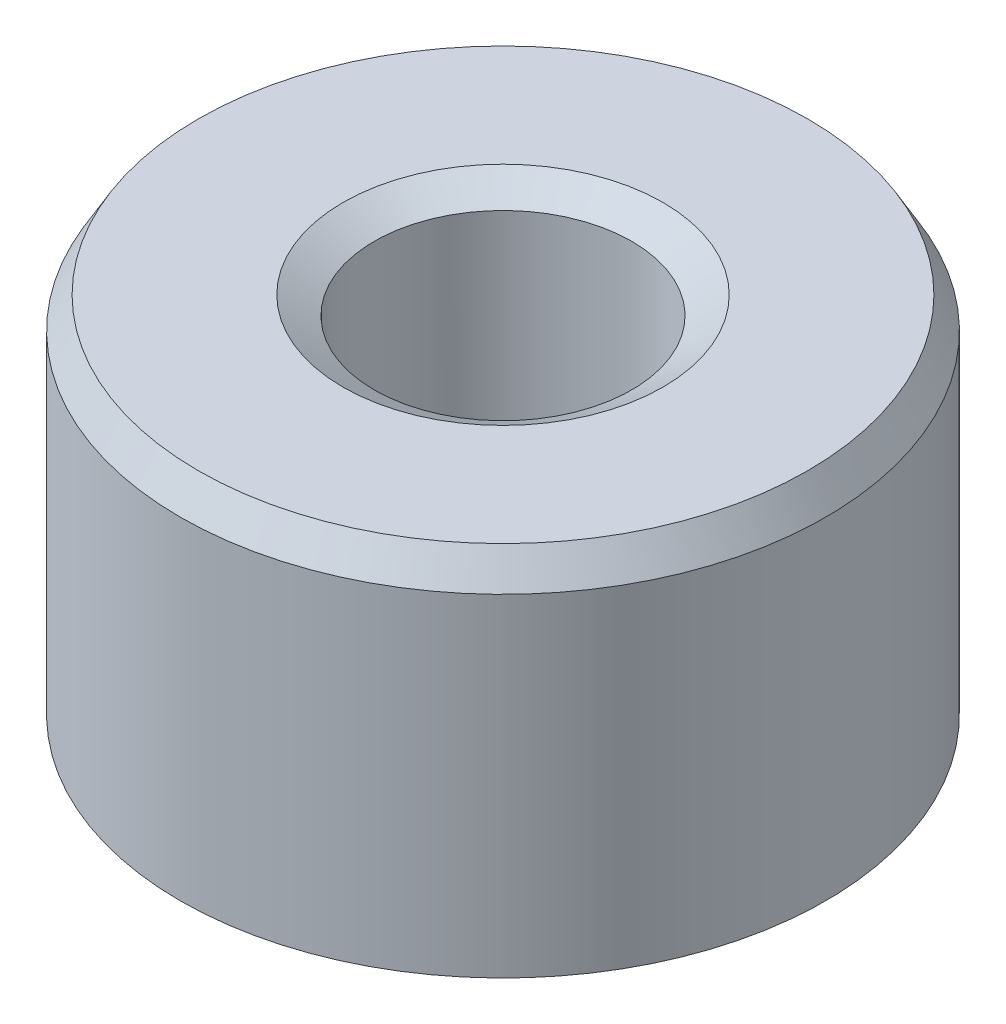
ISO-10303-21;
HEADER;
FILE_DESCRIPTION(('STEP AP214'),'2;1');
FILE_NAME('part.step','',(''),(''),'','','');
FILE_SCHEMA(('AUTOMOTIVE_DESIGN { 1 0 10303 214 1 1 1 1 }'));
ENDSEC;
DATA;
#1=APPLICATION_CONTEXT('core data for automotive mechanical design processes');
#2=APPLICATION_PROTOCOL_DEFINITION('international standard','automotive_design',2000,#1);
#3=PRODUCT_CONTEXT('',#1,'mechanical');
#4=PRODUCT('Part','Part','',(#3));
#5=PRODUCT_RELATED_PRODUCT_CATEGORY('part','',(#4));
#6=PRODUCT_DEFINITION_FORMATION('','',#4);
#7=PRODUCT_DEFINITION_CONTEXT('part definition',#1,'design');
#8=PRODUCT_DEFINITION('design','',#6,#7);
#9=PRODUCT_DEFINITION_SHAPE('','',#8);
#10=(LENGTH_UNIT() NAMED_UNIT(*) SI_UNIT(.MILLI.,.METRE.));
#11=(NAMED_UNIT(*) PLANE_ANGLE_UNIT() SI_UNIT($,.RADIAN.));
#12=(NAMED_UNIT(*) SI_UNIT($,.STERADIAN.) SOLID_ANGLE_UNIT());
#13=UNCERTAINTY_MEASURE_WITH_UNIT(LENGTH_MEASURE(1.E-05),#10,'distance_accuracy_value','');
#14=(GEOMETRIC_REPRESENTATION_CONTEXT(3) GLOBAL_UNCERTAINTY_ASSIGNED_CONTEXT((#13)) GLOBAL_UNIT_ASSIGNED_CONTEXT((#10,
#11,#12)) REPRESENTATION_CONTEXT('',''));
#15=CARTESIAN_POINT('',(0.,0.,0.));
#16=DIRECTION('',(0.,0.,1.));
#17=DIRECTION('',(1.,0.,0.));
#18=AXIS2_PLACEMENT_3D('',#15,#16,#17);
#19=CARTESIAN_POINT('',(0.,41.3737613750609,0.));
#20=DIRECTION('',(0.,-1.,0.));
#21=DIRECTION('',(0.,0.,-1.));
#22=AXIS2_PLACEMENT_3D('',#19,#20,#21);
#23=CYLINDRICAL_SURFACE('',#22,35.);
#24=CARTESIAN_POINT('',(0.,1.95443543057106,0.));
#25=DIRECTION('',(0.,1.,0.));
#26=DIRECTION('',(0.,0.,1.));
#27=AXIS2_PLACEMENT_3D('',#24,#25,#26);
#28=CIRCLE('',#27,35.);
#29=CARTESIAN_POINT('',(0.,1.95443543057105,-35.));
#30=VERTEX_POINT('',#29);
#31=EDGE_CURVE('E10',#30,#30,#28,.T.);
#32=CARTESIAN_POINT('',(0.,37.9885799091992,0.));
#33=DIRECTION('',(0.,1.,0.));
#34=DIRECTION('',(0.,0.,1.));
#35=AXIS2_PLACEMENT_3D('',#32,#33,#34);
#36=CIRCLE('',#35,35.);
#37=CARTESIAN_POINT('',(0.,37.9885799091992,-35.));
#38=VERTEX_POINT('',#37);
#39=EDGE_CURVE('E50',#38,#38,#36,.F.);
#40=CARTESIAN_POINT('',(0.,1.95443543057105,-35.));
#41=CARTESIAN_POINT('',(0.,2.32979110222342,-35.));
#42=CARTESIAN_POINT('',(0.,2.7051467738758,-35.));
#43=CARTESIAN_POINT('',(0.,3.45585811718055,-35.));
#44=CARTESIAN_POINT('',(0.,3.83121378883293,-35.));
#45=CARTESIAN_POINT('',(0.,4.58192513213769,-35.));
#46=CARTESIAN_POINT('',(0.,4.95728080379006,-35.));
#47=CARTESIAN_POINT('',(0.,5.70799214709481,-35.));
#48=CARTESIAN_POINT('',(0.,6.08334781874719,-35.));
#49=CARTESIAN_POINT('',(0.,6.83405916205195,-35.));
#50=CARTESIAN_POINT('',(0.,7.20941483370432,-35.));
#51=CARTESIAN_POINT('',(0.,7.96012617700907,-35.));
#52=CARTESIAN_POINT('',(0.,8.33548184866145,-35.));
#53=CARTESIAN_POINT('',(0.,9.0861931919662,-35.));
#54=CARTESIAN_POINT('',(0.,9.46154886361858,-35.));
#55=CARTESIAN_POINT('',(0.,10.2122602069233,-35.));
#56=CARTESIAN_POINT('',(0.,10.5876158785757,-35.));
#57=CARTESIAN_POINT('',(0.,11.3383272218805,-35.));
#58=CARTESIAN_POINT('',(0.,11.7136828935328,-35.));
#59=CARTESIAN_POINT('',(0.,12.4643942368376,-35.));
#60=CARTESIAN_POINT('',(0.,12.83974990849,-35.));
#61=CARTESIAN_POINT('',(0.,13.5904612517947,-35.));
#62=CARTESIAN_POINT('',(0.,13.9658169234471,-35.));
#63=CARTESIAN_POINT('',(0.,14.7165282667518,-35.));
#64=CARTESIAN_POINT('',(0.,15.0918839384042,-35.));
#65=CARTESIAN_POINT('',(0.,15.842595281709,-35.));
#66=CARTESIAN_POINT('',(0.,16.2179509533614,-35.));
#67=CARTESIAN_POINT('',(0.,16.9686622966661,-35.));
#68=CARTESIAN_POINT('',(0.,17.3440179683185,-35.));
#69=CARTESIAN_POINT('',(0.,18.0947293116232,-35.));
#70=CARTESIAN_POINT('',(0.,18.4700849832756,-35.));
#71=CARTESIAN_POINT('',(0.,19.2207963265804,-35.));
#72=CARTESIAN_POINT('',(0.,19.5961519982327,-35.));
#73=CARTESIAN_POINT('',(0.,20.3468633415375,-35.));
#74=CARTESIAN_POINT('',(0.,20.7222190131899,-35.));
#75=CARTESIAN_POINT('',(0.,21.4729303564946,-35.));
#76=CARTESIAN_POINT('',(0.,21.848286028147,-35.));
#77=CARTESIAN_POINT('',(0.,22.5989973714518,-35.));
#78=CARTESIAN_POINT('',(0.,22.9743530431041,-35.));
#79=CARTESIAN_POINT('',(0.,23.7250643864089,-35.));
#80=CARTESIAN_POINT('',(0.,24.1004200580613,-35.));
#81=CARTESIAN_POINT('',(0.,24.851131401366,-35.));
#82=CARTESIAN_POINT('',(0.,25.2264870730184,-35.));
#83=CARTESIAN_POINT('',(0.,25.9771984163231,-35.));
#84=CARTESIAN_POINT('',(0.,26.3525540879755,-35.));
#85=CARTESIAN_POINT('',(0.,27.1032654312803,-35.));
#86=CARTESIAN_POINT('',(0.,27.4786211029327,-35.));
#87=CARTESIAN_POINT('',(0.,28.2293324462374,-35.));
#88=CARTESIAN_POINT('',(0.,28.6046881178898,-35.));
#89=CARTESIAN_POINT('',(0.,29.3553994611945,-35.));
#90=CARTESIAN_POINT('',(0.,29.7307551328469,-35.));
#91=CARTESIAN_POINT('',(0.,30.4814664761517,-35.));
#92=CARTESIAN_POINT('',(0.,30.856822147804,-35.));
#93=CARTESIAN_POINT('',(0.,31.6075334911088,-35.));
#94=CARTESIAN_POINT('',(0.,31.9828891627612,-35.));
#95=CARTESIAN_POINT('',(0.,32.7336005060659,-35.));
#96=CARTESIAN_POINT('',(0.,33.1089561777183,-35.));
#97=CARTESIAN_POINT('',(0.,33.8596675210231,-35.));
#98=CARTESIAN_POINT('',(0.,34.2350231926754,-35.));
#99=CARTESIAN_POINT('',(0.,34.9857345359802,-35.));
#100=CARTESIAN_POINT('',(0.,35.3610902076326,-35.));
#101=CARTESIAN_POINT('',(0.,36.1118015509373,-35.));
#102=CARTESIAN_POINT('',(0.,36.4871572225897,-35.));
#103=CARTESIAN_POINT('',(0.,37.2378685658944,-35.));
#104=CARTESIAN_POINT('',(0.,37.6132242375468,-35.));
#105=CARTESIAN_POINT('',(0.,37.9885799091992,-35.));
#106=B_SPLINE_CURVE_WITH_KNOTS('',3,(#40,#41,#42,#43,#44,#45,#46,#47,#48,#49,#50,#51,#52,#53,
#54,#55,#56,#57,#58,#59,#60,#61,#62,#63,#64,#65,#66,#67,#68,#69,#70,#71,#72,#73,#74,#75,#76,#77,
#78,#79,#80,#81,#82,#83,#84,#85,#86,#87,#88,#89,#90,#91,#92,#93,#94,#95,#96,#97,#98,#99,#100,
#101,#102,#103,#104,#105),.UNSPECIFIED.,.F.,.F.,(4,2,2,2,2,2,2,2,2,2,2,2,2,2,2,2,2,2,2,2,2,2,2,
2,2,2,2,2,2,2,2,2,4),(0.,1.12606701495713,2.25213402991426,3.37820104487139,4.50426805982852,
5.63033507478565,6.75640208974278,7.8824691046999,9.00853611965704,10.1346031346142,
11.2606701495713,12.3867371645284,13.5128041794856,14.6388711944427,15.7649382093998,
16.8910052243569,18.0170722393141,19.1431392542712,20.2692062692283,21.3952732841855,
22.5213402991426,23.6474073140997,24.7734743290568,25.899541344014,27.0256083589711,
28.1516753739282,29.2777423888854,30.4038094038425,31.5298764187996,32.6559434337568,
33.7820104487139,34.908077463671,36.0341444786281),.UNSPECIFIED.);
#107=EDGE_CURVE('BSEAM39',#30,#38,#106,.T.);
#108=ORIENTED_EDGE('',*,*,#31,.T.);
#109=ORIENTED_EDGE('',*,*,#39,.T.);
#110=ORIENTED_EDGE('',*,*,#107,.T.);
#111=ORIENTED_EDGE('',*,*,#107,.F.);
#112=EDGE_LOOP('',(#108,#110,#109,#111));
#113=FACE_BOUND('',#112,.T.);
#114=ADVANCED_FACE('F39',(#113),#23,.T.);
#115=CARTESIAN_POINT('',(0.,41.3737613750609,0.));
#116=DIRECTION('',(0.,1.,0.));
#117=DIRECTION('',(0.,0.,1.));
#118=AXIS2_PLACEMENT_3D('',#115,#116,#117);
#119=PLANE('',#118);
#120=CARTESIAN_POINT('',(0.,41.3737613750609,0.));
#121=DIRECTION('',(0.,1.,0.));
#122=DIRECTION('',(0.,0.,1.));
#123=AXIS2_PLACEMENT_3D('',#120,#121,#122);
#124=CIRCLE('',#123,17.3493188126822);
#125=CARTESIAN_POINT('',(0.,41.3737613750609,17.3493188126822));
#126=VERTEX_POINT('',#125);
#127=EDGE_CURVE('E58',#126,#126,#124,.F.);
#128=ORIENTED_EDGE('',*,*,#127,.T.);
#129=EDGE_LOOP('',(#128));
#130=FACE_BOUND('',#129,.T.);
#131=CARTESIAN_POINT('',(0.,41.3737613750609,0.));
#132=DIRECTION('',(0.,1.,0.));
#133=DIRECTION('',(0.,0.,1.));
#134=AXIS2_PLACEMENT_3D('',#131,#132,#133);
#135=CIRCLE('',#134,33.045564569429);
#136=CARTESIAN_POINT('',(0.,41.3737613750609,33.045564569429));
#137=VERTEX_POINT('',#136);
#138=EDGE_CURVE('E61',#137,#137,#135,.T.);
#139=ORIENTED_EDGE('',*,*,#138,.T.);
#140=EDGE_LOOP('',(#139));
#141=FACE_BOUND('',#140,.T.);
#142=ADVANCED_FACE('F88',(#130,#141),#119,.T.);
#143=CARTESIAN_POINT('',(0.,0.,0.));
#144=DIRECTION('',(0.,1.,0.));
#145=DIRECTION('',(0.,0.,1.));
#146=AXIS2_PLACEMENT_3D('',#143,#144,#145);
#147=PLANE('',#146);
#148=CARTESIAN_POINT('',(0.,0.,0.));
#149=DIRECTION('',(0.,1.,0.));
#150=DIRECTION('',(0.,0.,1.));
#151=AXIS2_PLACEMENT_3D('',#148,#149,#150);
#152=CIRCLE('',#151,15.9185727773913);
#153=CARTESIAN_POINT('',(0.,0.,15.9185727773913));
#154=VERTEX_POINT('',#153);
#155=EDGE_CURVE('E51',#154,#154,#152,.T.);
#156=ORIENTED_EDGE('',*,*,#155,.T.);
#157=EDGE_LOOP('',(#156));
#158=FACE_BOUND('',#157,.T.);
#159=CARTESIAN_POINT('',(0.,0.,0.));
#160=DIRECTION('',(0.,1.,0.));
#161=DIRECTION('',(0.,0.,1.));
#162=AXIS2_PLACEMENT_3D('',#159,#160,#161);
#163=CIRCLE('',#162,31.6148185341382);
#164=CARTESIAN_POINT('',(0.,0.,31.6148185341382));
#165=VERTEX_POINT('',#164);
#166=EDGE_CURVE('E54',#165,#165,#163,.F.);
#167=ORIENTED_EDGE('',*,*,#166,.T.);
#168=EDGE_LOOP('',(#167));
#169=FACE_BOUND('',#168,.T.);
#170=ADVANCED_FACE('F83',(#158,#169),#147,.F.);
#171=CARTESIAN_POINT('',(0.,41.3737613750609,0.));
#172=DIRECTION('',(0.,-1.,0.));
#173=DIRECTION('',(0.,0.,-1.));
#174=AXIS2_PLACEMENT_3D('',#171,#172,#173);
#175=CYLINDRICAL_SURFACE('',#174,13.9641373468203);
#176=CARTESIAN_POINT('',(0.,39.4193259444899,0.));
#177=DIRECTION('',(0.,1.,0.));
#178=DIRECTION('',(0.,0.,1.));
#179=AXIS2_PLACEMENT_3D('',#176,#177,#178);
#180=CIRCLE('',#179,13.9641373468203);
#181=CARTESIAN_POINT('',(0.,39.4193259444898,-13.9641373468203));
#182=VERTEX_POINT('',#181);
#183=EDGE_CURVE('E67',#182,#182,#180,.T.);
#184=CARTESIAN_POINT('',(0.,3.38518146586177,0.));
#185=DIRECTION('',(0.,1.,0.));
#186=DIRECTION('',(0.,0.,1.));
#187=AXIS2_PLACEMENT_3D('',#184,#185,#186);
#188=CIRCLE('',#187,13.9641373468203);
#189=CARTESIAN_POINT('',(0.,3.38518146586176,-13.9641373468203));
#190=VERTEX_POINT('',#189);
#191=EDGE_CURVE('E69',#190,#190,#188,.F.);
#192=CARTESIAN_POINT('',(0.,39.4193259444898,-13.9641373468203));
#193=CARTESIAN_POINT('',(0.,39.0439702728375,-13.9641373468203));
#194=CARTESIAN_POINT('',(0.,38.6686146011851,-13.9641373468203));
#195=CARTESIAN_POINT('',(0.,37.9179032578803,-13.9641373468203));
#196=CARTESIAN_POINT('',(0.,37.542547586228,-13.9641373468203));
#197=CARTESIAN_POINT('',(0.,36.7918362429232,-13.9641373468203));
#198=CARTESIAN_POINT('',(0.,36.4164805712708,-13.9641373468203));
#199=CARTESIAN_POINT('',(0.,35.6657692279661,-13.9641373468203));
#200=CARTESIAN_POINT('',(0.,35.2904135563137,-13.9641373468203));
#201=CARTESIAN_POINT('',(0.,34.539702213009,-13.9641373468203));
#202=CARTESIAN_POINT('',(0.,34.1643465413566,-13.9641373468203));
#203=CARTESIAN_POINT('',(0.,33.4136351980518,-13.9641373468203));
#204=CARTESIAN_POINT('',(0.,33.0382795263995,-13.9641373468203));
#205=CARTESIAN_POINT('',(0.,32.2875681830947,-13.9641373468203));
#206=CARTESIAN_POINT('',(0.,31.9122125114423,-13.9641373468203));
#207=CARTESIAN_POINT('',(0.,31.1615011681376,-13.9641373468203));
#208=CARTESIAN_POINT('',(0.,30.7861454964852,-13.9641373468203));
#209=CARTESIAN_POINT('',(0.,30.0354341531805,-13.9641373468203));
#210=CARTESIAN_POINT('',(0.,29.6600784815281,-13.9641373468203));
#211=CARTESIAN_POINT('',(0.,28.9093671382233,-13.9641373468203));
#212=CARTESIAN_POINT('',(0.,28.5340114665709,-13.9641373468203));
#213=CARTESIAN_POINT('',(0.,27.7833001232662,-13.9641373468203));
#214=CARTESIAN_POINT('',(0.,27.4079444516138,-13.9641373468203));
#215=CARTESIAN_POINT('',(0.,26.6572331083091,-13.9641373468203));
#216=CARTESIAN_POINT('',(0.,26.2818774366567,-13.9641373468203));
#217=CARTESIAN_POINT('',(0.,25.5311660933519,-13.9641373468203));
#218=CARTESIAN_POINT('',(0.,25.1558104216996,-13.9641373468203));
#219=CARTESIAN_POINT('',(0.,24.4050990783948,-13.9641373468203));
#220=CARTESIAN_POINT('',(0.,24.0297434067424,-13.9641373468203));
#221=CARTESIAN_POINT('',(0.,23.2790320634377,-13.9641373468203));
#222=CARTESIAN_POINT('',(0.,22.9036763917853,-13.9641373468203));
#223=CARTESIAN_POINT('',(0.,22.1529650484806,-13.9641373468203));
#224=CARTESIAN_POINT('',(0.,21.7776093768282,-13.9641373468203));
#225=CARTESIAN_POINT('',(0.,21.0268980335234,-13.9641373468203));
#226=CARTESIAN_POINT('',(0.,20.6515423618711,-13.9641373468203));
#227=CARTESIAN_POINT('',(0.,19.9008310185663,-13.9641373468203));
#228=CARTESIAN_POINT('',(0.,19.5254753469139,-13.9641373468203));
#229=CARTESIAN_POINT('',(0.,18.7747640036092,-13.9641373468203));
#230=CARTESIAN_POINT('',(0.,18.3994083319568,-13.9641373468203));
#231=CARTESIAN_POINT('',(0.,17.648696988652,-13.9641373468203));
#232=CARTESIAN_POINT('',(0.,17.2733413169997,-13.9641373468203));
#233=CARTESIAN_POINT('',(0.,16.5226299736949,-13.9641373468203));
#234=CARTESIAN_POINT('',(0.,16.1472743020425,-13.9641373468203));
#235=CARTESIAN_POINT('',(0.,15.3965629587378,-13.9641373468203));
#236=CARTESIAN_POINT('',(0.,15.0212072870854,-13.9641373468203));
#237=CARTESIAN_POINT('',(0.,14.2704959437807,-13.9641373468203));
#238=CARTESIAN_POINT('',(0.,13.8951402721283,-13.9641373468203));
#239=CARTESIAN_POINT('',(0.,13.1444289288235,-13.9641373468203));
#240=CARTESIAN_POINT('',(0.,12.7690732571712,-13.9641373468203));
#241=CARTESIAN_POINT('',(0.,12.0183619138664,-13.9641373468203));
#242=CARTESIAN_POINT('',(0.,11.643006242214,-13.9641373468203));
#243=CARTESIAN_POINT('',(0.,10.8922948989093,-13.9641373468203));
#244=CARTESIAN_POINT('',(0.,10.5169392272569,-13.9641373468203));
#245=CARTESIAN_POINT('',(0.,9.76622788395215,-13.9641373468203));
#246=CARTESIAN_POINT('',(0.,9.39087221229978,-13.9641373468203));
#247=CARTESIAN_POINT('',(0.,8.64016086899503,-13.9641373468203));
#248=CARTESIAN_POINT('',(0.,8.26480519734265,-13.9641373468203));
#249=CARTESIAN_POINT('',(0.,7.51409385403789,-13.9641373468203));
#250=CARTESIAN_POINT('',(0.,7.13873818238552,-13.9641373468203));
#251=CARTESIAN_POINT('',(0.,6.38802683908077,-13.9641373468203));
#252=CARTESIAN_POINT('',(0.,6.01267116742839,-13.9641373468203));
#253=CARTESIAN_POINT('',(0.,5.26195982412364,-13.9641373468203));
#254=CARTESIAN_POINT('',(0.,4.88660415247126,-13.9641373468203));
#255=CARTESIAN_POINT('',(0.,4.13589280916651,-13.9641373468203));
#256=CARTESIAN_POINT('',(0.,3.76053713751414,-13.9641373468203));
#257=CARTESIAN_POINT('',(0.,3.38518146586176,-13.9641373468203));
#258=B_SPLINE_CURVE_WITH_KNOTS('',3,(#192,#193,#194,#195,#196,#197,#198,#199,#200,#201,#202,
#203,#204,#205,#206,#207,#208,#209,#210,#211,#212,#213,#214,#215,#216,#217,#218,#219,#220,#221,
#222,#223,#224,#225,#226,#227,#228,#229,#230,#231,#232,#233,#234,#235,#236,#237,#238,#239,#240,
#241,#242,#243,#244,#245,#246,#247,#248,#249,#250,#251,#252,#253,#254,#255,#256,#257),
.UNSPECIFIED.,.F.,.F.,(4,2,2,2,2,2,2,2,2,2,2,2,2,2,2,2,2,2,2,2,2,2,2,2,2,2,2,2,2,2,2,2,4),(0.,
1.12606701495713,2.25213402991425,3.37820104487138,4.50426805982851,5.63033507478564,
6.75640208974276,7.88246910469989,9.00853611965702,10.1346031346141,11.2606701495713,
12.3867371645284,13.5128041794855,14.6388711944427,15.7649382093998,16.8910052243569,
18.017072239314,19.1431392542712,20.2692062692283,21.3952732841854,22.5213402991426,
23.6474073140997,24.7734743290568,25.8995413440139,27.0256083589711,28.1516753739282,
29.2777423888853,30.4038094038424,31.5298764187996,32.6559434337567,33.7820104487138,
34.908077463671,36.0341444786281),.UNSPECIFIED.);
#259=EDGE_CURVE('BSEAM71',#182,#190,#258,.T.);
#260=ORIENTED_EDGE('',*,*,#183,.T.);
#261=ORIENTED_EDGE('',*,*,#191,.T.);
#262=ORIENTED_EDGE('',*,*,#259,.T.);
#263=ORIENTED_EDGE('',*,*,#259,.F.);
#264=EDGE_LOOP('',(#260,#262,#261,#263));
#265=FACE_BOUND('',#264,.T.);
#266=ADVANCED_FACE('F71',(#265),#175,.F.);
#267=CARTESIAN_POINT('',(0.,39.4193259444899,0.));
#268=DIRECTION('',(0.,1.,0.));
#269=DIRECTION('',(0.,0.,1.));
#270=AXIS2_PLACEMENT_3D('',#267,#268,#269);
#271=CONICAL_SURFACE('',#270,13.9641373468203,1.0471975511966);
#272=ORIENTED_EDGE('',*,*,#127,.F.);
#273=EDGE_LOOP('',(#272));
#274=FACE_BOUND('',#273,.T.);
#275=ORIENTED_EDGE('',*,*,#183,.F.);
#276=EDGE_LOOP('',(#275));
#277=FACE_BOUND('',#276,.T.);
#278=ADVANCED_FACE('F77',(#274,#277),#271,.F.);
#279=CARTESIAN_POINT('',(0.,0.,0.));
#280=DIRECTION('',(0.,-1.,0.));
#281=DIRECTION('',(0.,0.,-1.));
#282=AXIS2_PLACEMENT_3D('',#279,#280,#281);
#283=CONICAL_SURFACE('',#282,15.9185727773913,0.523598775598293);
#284=ORIENTED_EDGE('',*,*,#191,.F.);
#285=EDGE_LOOP('',(#284));
#286=FACE_BOUND('',#285,.T.);
#287=ORIENTED_EDGE('',*,*,#155,.F.);
#288=EDGE_LOOP('',(#287));
#289=FACE_BOUND('',#288,.T.);
#290=ADVANCED_FACE('F73',(#286,#289),#283,.F.);
#291=CARTESIAN_POINT('',(0.,1.95443543057106,0.));
#292=DIRECTION('',(0.,1.,0.));
#293=DIRECTION('',(0.,0.,1.));
#294=AXIS2_PLACEMENT_3D('',#291,#292,#293);
#295=CONICAL_SURFACE('',#294,35.,1.0471975511966);
#296=ORIENTED_EDGE('',*,*,#166,.F.);
#297=EDGE_LOOP('',(#296));
#298=FACE_BOUND('',#297,.T.);
#299=ORIENTED_EDGE('',*,*,#31,.F.);
#300=EDGE_LOOP('',(#299));
#301=FACE_BOUND('',#300,.T.);
#302=ADVANCED_FACE('F76',(#298,#301),#295,.T.);
#303=CARTESIAN_POINT('',(0.,41.3737613750609,0.));
#304=DIRECTION('',(0.,-1.,0.));
#305=DIRECTION('',(0.,0.,-1.));
#306=AXIS2_PLACEMENT_3D('',#303,#304,#305);
#307=CONICAL_SURFACE('',#306,33.045564569429,0.523598775598295);
#308=ORIENTED_EDGE('',*,*,#39,.F.);
#309=EDGE_LOOP('',(#308));
#310=FACE_BOUND('',#309,.T.);
#311=ORIENTED_EDGE('',*,*,#138,.F.);
#312=EDGE_LOOP('',(#311));
#313=FACE_BOUND('',#312,.T.);
#314=ADVANCED_FACE('F45',(#310,#313),#307,.T.);
#315=CLOSED_SHELL('',(#114,#142,#170,#266,#278,#290,#302,#314));
#316=MANIFOLD_SOLID_BREP('B2',#315);
#317=ADVANCED_BREP_SHAPE_REPRESENTATION('',(#18,#316),#14);
#318=SHAPE_DEFINITION_REPRESENTATION(#9,#317);
ENDSEC;
END-ISO-10303-21;
